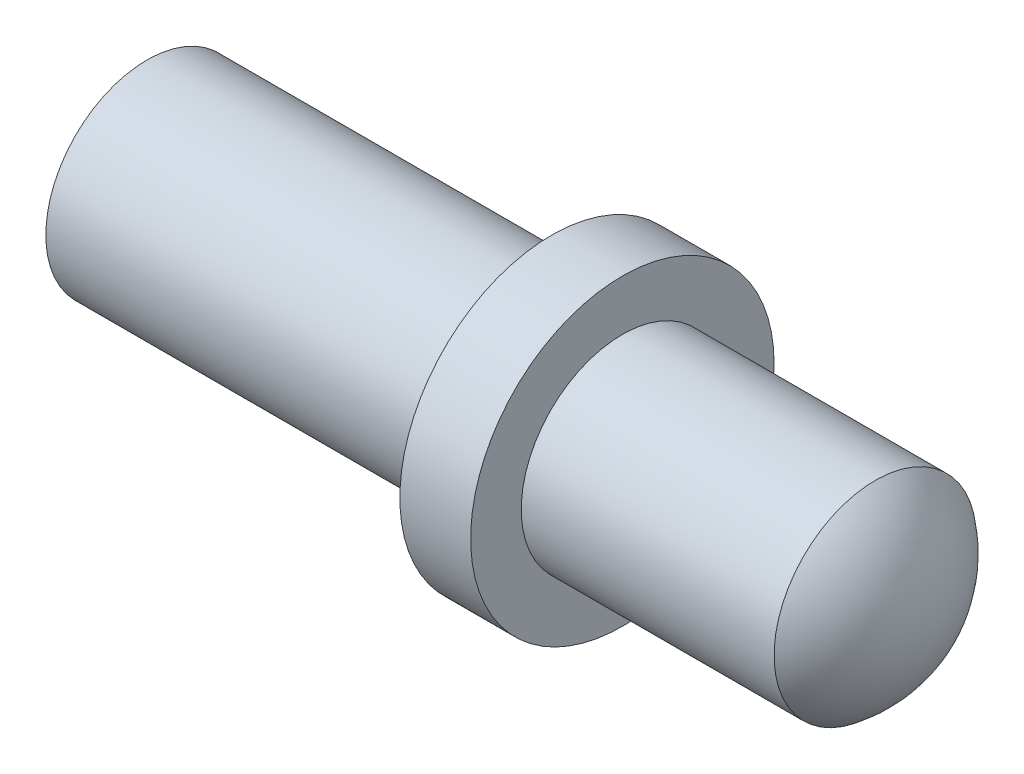
ISO-10303-21;
HEADER;
FILE_DESCRIPTION(('STEP AP214'),'2;1');
FILE_NAME('part.step','',(''),(''),'','','');
FILE_SCHEMA(('AUTOMOTIVE_DESIGN { 1 0 10303 214 1 1 1 1 }'));
ENDSEC;
DATA;
#1=APPLICATION_CONTEXT('core data for automotive mechanical design processes');
#2=APPLICATION_PROTOCOL_DEFINITION('international standard','automotive_design',2000,#1);
#3=PRODUCT_CONTEXT('',#1,'mechanical');
#4=PRODUCT('Part','Part','',(#3));
#5=PRODUCT_RELATED_PRODUCT_CATEGORY('part','',(#4));
#6=PRODUCT_DEFINITION_FORMATION('','',#4);
#7=PRODUCT_DEFINITION_CONTEXT('part definition',#1,'design');
#8=PRODUCT_DEFINITION('design','',#6,#7);
#9=PRODUCT_DEFINITION_SHAPE('','',#8);
#10=(LENGTH_UNIT() NAMED_UNIT(*) SI_UNIT(.MILLI.,.METRE.));
#11=(NAMED_UNIT(*) PLANE_ANGLE_UNIT() SI_UNIT($,.RADIAN.));
#12=(NAMED_UNIT(*) SI_UNIT($,.STERADIAN.) SOLID_ANGLE_UNIT());
#13=UNCERTAINTY_MEASURE_WITH_UNIT(LENGTH_MEASURE(1.E-05),#10,'distance_accuracy_value','');
#14=(GEOMETRIC_REPRESENTATION_CONTEXT(3) GLOBAL_UNCERTAINTY_ASSIGNED_CONTEXT((#13)) GLOBAL_UNIT_ASSIGNED_CONTEXT((#10,
#11,#12)) REPRESENTATION_CONTEXT('',''));
#15=CARTESIAN_POINT('',(0.,0.,0.));
#16=DIRECTION('',(0.,0.,1.));
#17=DIRECTION('',(1.,0.,0.));
#18=AXIS2_PLACEMENT_3D('',#15,#16,#17);
#19=CARTESIAN_POINT('',(0.,0.,0.));
#20=DIRECTION('',(-1.,0.,0.));
#21=DIRECTION('',(0.,0.,1.));
#22=AXIS2_PLACEMENT_3D('',#19,#20,#21);
#23=PLANE('',#22);
#24=CARTESIAN_POINT('',(0.,0.,0.));
#25=DIRECTION('',(1.,0.,0.));
#26=DIRECTION('',(0.,0.,-1.));
#27=AXIS2_PLACEMENT_3D('',#24,#25,#26);
#28=CIRCLE('',#27,2.);
#29=CARTESIAN_POINT('',(0.,0.,-2.));
#30=VERTEX_POINT('',#29);
#31=EDGE_CURVE('E11',#30,#30,#28,.T.);
#32=ORIENTED_EDGE('',*,*,#31,.F.);
#33=EDGE_LOOP('',(#32));
#34=FACE_BOUND('',#33,.T.);
#35=ADVANCED_FACE('F36',(#34),#23,.T.);
#36=CARTESIAN_POINT('',(14.4,0.,0.));
#37=DIRECTION('',(1.,0.,0.));
#38=DIRECTION('',(0.,0.,-1.));
#39=AXIS2_PLACEMENT_3D('',#36,#37,#38);
#40=CYLINDRICAL_SURFACE('',#39,2.);
#41=ORIENTED_EDGE('',*,*,#31,.T.);
#42=EDGE_LOOP('',(#41));
#43=FACE_BOUND('',#42,.T.);
#44=CARTESIAN_POINT('',(8.,0.,0.));
#45=DIRECTION('',(1.,0.,0.));
#46=DIRECTION('',(0.,0.,-1.));
#47=AXIS2_PLACEMENT_3D('',#44,#45,#46);
#48=CIRCLE('',#47,2.);
#49=CARTESIAN_POINT('',(8.,0.,-2.));
#50=VERTEX_POINT('',#49);
#51=EDGE_CURVE('E44',#50,#50,#48,.T.);
#52=ORIENTED_EDGE('',*,*,#51,.F.);
#53=EDGE_LOOP('',(#52));
#54=FACE_BOUND('',#53,.T.);
#55=ADVANCED_FACE('F77',(#43,#54),#40,.T.);
#56=CARTESIAN_POINT('',(8.,2.,0.));
#57=DIRECTION('',(-1.,0.,0.));
#58=DIRECTION('',(0.,0.,1.));
#59=AXIS2_PLACEMENT_3D('',#56,#57,#58);
#60=PLANE('',#59);
#61=ORIENTED_EDGE('',*,*,#51,.T.);
#62=EDGE_LOOP('',(#61));
#63=FACE_BOUND('',#62,.T.);
#64=CARTESIAN_POINT('',(8.,0.,0.));
#65=DIRECTION('',(1.,0.,0.));
#66=DIRECTION('',(0.,0.,-1.));
#67=AXIS2_PLACEMENT_3D('',#64,#65,#66);
#68=CIRCLE('',#67,3.);
#69=CARTESIAN_POINT('',(8.,0.,-3.));
#70=VERTEX_POINT('',#69);
#71=EDGE_CURVE('E48',#70,#70,#68,.T.);
#72=ORIENTED_EDGE('',*,*,#71,.F.);
#73=EDGE_LOOP('',(#72));
#74=FACE_BOUND('',#73,.T.);
#75=ADVANCED_FACE('F82',(#63,#74),#60,.T.);
#76=CARTESIAN_POINT('',(14.4,0.,0.));
#77=DIRECTION('',(1.,0.,0.));
#78=DIRECTION('',(0.,0.,-1.));
#79=AXIS2_PLACEMENT_3D('',#76,#77,#78);
#80=CYLINDRICAL_SURFACE('',#79,3.);
#81=ORIENTED_EDGE('',*,*,#71,.T.);
#82=EDGE_LOOP('',(#81));
#83=FACE_BOUND('',#82,.T.);
#84=CARTESIAN_POINT('',(9.4,0.,0.));
#85=DIRECTION('',(1.,0.,0.));
#86=DIRECTION('',(0.,0.,-1.));
#87=AXIS2_PLACEMENT_3D('',#84,#85,#86);
#88=CIRCLE('',#87,3.);
#89=CARTESIAN_POINT('',(9.4,0.,-3.));
#90=VERTEX_POINT('',#89);
#91=EDGE_CURVE('E54',#90,#90,#88,.T.);
#92=ORIENTED_EDGE('',*,*,#91,.F.);
#93=EDGE_LOOP('',(#92));
#94=FACE_BOUND('',#93,.T.);
#95=ADVANCED_FACE('F73',(#83,#94),#80,.T.);
#96=CARTESIAN_POINT('',(9.4,3.,0.));
#97=DIRECTION('',(1.,0.,0.));
#98=DIRECTION('',(0.,0.,-1.));
#99=AXIS2_PLACEMENT_3D('',#96,#97,#98);
#100=PLANE('',#99);
#101=ORIENTED_EDGE('',*,*,#91,.T.);
#102=EDGE_LOOP('',(#101));
#103=FACE_BOUND('',#102,.T.);
#104=CARTESIAN_POINT('',(9.4,0.,0.));
#105=DIRECTION('',(1.,0.,0.));
#106=DIRECTION('',(0.,0.,-1.));
#107=AXIS2_PLACEMENT_3D('',#104,#105,#106);
#108=CIRCLE('',#107,1.99999999999999);
#109=CARTESIAN_POINT('',(9.4,0.,-1.99999999999999));
#110=VERTEX_POINT('',#109);
#111=EDGE_CURVE('E57',#110,#110,#108,.T.);
#112=ORIENTED_EDGE('',*,*,#111,.F.);
#113=EDGE_LOOP('',(#112));
#114=FACE_BOUND('',#113,.T.);
#115=ADVANCED_FACE('F67',(#103,#114),#100,.T.);
#116=CARTESIAN_POINT('',(14.4,0.,0.));
#117=DIRECTION('',(1.,0.,0.));
#118=DIRECTION('',(0.,0.,-1.));
#119=AXIS2_PLACEMENT_3D('',#116,#117,#118);
#120=CYLINDRICAL_SURFACE('',#119,1.99999999999999);
#121=ORIENTED_EDGE('',*,*,#111,.T.);
#122=EDGE_LOOP('',(#121));
#123=FACE_BOUND('',#122,.T.);
#124=CARTESIAN_POINT('',(14.4,0.,0.));
#125=DIRECTION('',(1.,0.,0.));
#126=DIRECTION('',(0.,0.,-1.));
#127=AXIS2_PLACEMENT_3D('',#124,#125,#126);
#128=CIRCLE('',#127,1.99999999999999);
#129=CARTESIAN_POINT('',(14.4,0.,-1.99999999999999));
#130=VERTEX_POINT('',#129);
#131=EDGE_CURVE('E40',#130,#130,#128,.T.);
#132=ORIENTED_EDGE('',*,*,#131,.F.);
#133=EDGE_LOOP('',(#132));
#134=FACE_BOUND('',#133,.T.);
#135=ADVANCED_FACE('F65',(#123,#134),#120,.T.);
#136=CARTESIAN_POINT('',(12.9,0.,0.));
#137=DIRECTION('',(0.,0.,1.));
#138=DIRECTION('',(1.,0.,0.));
#139=AXIS2_PLACEMENT_3D('',#136,#137,#138);
#140=SPHERICAL_SURFACE('',#139,2.49999999999999);
#141=CARTESIAN_POINT('',(12.9,0.,0.));
#142=DIRECTION('',(1.,0.,0.));
#143=DIRECTION('',(0.,0.,-1.));
#144=AXIS2_PLACEMENT_3D('',#141,#142,#143);
#145=SPHERICAL_SURFACE('',#144,2.49999999999999);
#146=ORIENTED_EDGE('',*,*,#131,.T.);
#147=EDGE_LOOP('',(#146));
#148=FACE_BOUND('',#147,.T.);
#149=ADVANCED_FACE('F38',(#148),#145,.T.);
#150=CLOSED_SHELL('',(#35,#55,#75,#95,#115,#135,#149));
#151=MANIFOLD_SOLID_BREP('B2',#150);
#152=ADVANCED_BREP_SHAPE_REPRESENTATION('',(#18,#151),#14);
#153=SHAPE_DEFINITION_REPRESENTATION(#9,#152);
ENDSEC;
END-ISO-10303-21;
